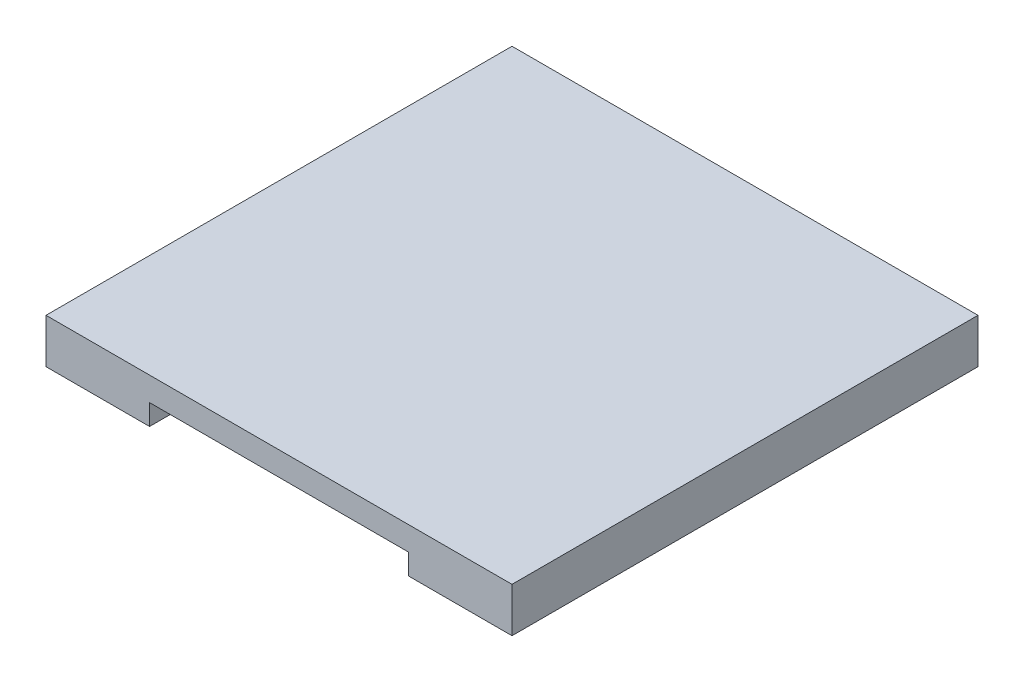
ISO-10303-21;
HEADER;
FILE_DESCRIPTION(('STEP AP214'),'2;1');
FILE_NAME('part.step','',(''),(''),'','','');
FILE_SCHEMA(('AUTOMOTIVE_DESIGN { 1 0 10303 214 1 1 1 1 }'));
ENDSEC;
DATA;
#1=APPLICATION_CONTEXT('core data for automotive mechanical design processes');
#2=APPLICATION_PROTOCOL_DEFINITION('international standard','automotive_design',2000,#1);
#3=PRODUCT_CONTEXT('',#1,'mechanical');
#4=PRODUCT('Part','Part','',(#3));
#5=PRODUCT_RELATED_PRODUCT_CATEGORY('part','',(#4));
#6=PRODUCT_DEFINITION_FORMATION('','',#4);
#7=PRODUCT_DEFINITION_CONTEXT('part definition',#1,'design');
#8=PRODUCT_DEFINITION('design','',#6,#7);
#9=PRODUCT_DEFINITION_SHAPE('','',#8);
#10=(LENGTH_UNIT() NAMED_UNIT(*) SI_UNIT(.MILLI.,.METRE.));
#11=(NAMED_UNIT(*) PLANE_ANGLE_UNIT() SI_UNIT($,.RADIAN.));
#12=(NAMED_UNIT(*) SI_UNIT($,.STERADIAN.) SOLID_ANGLE_UNIT());
#13=UNCERTAINTY_MEASURE_WITH_UNIT(LENGTH_MEASURE(1.E-05),#10,'distance_accuracy_value','');
#14=(GEOMETRIC_REPRESENTATION_CONTEXT(3) GLOBAL_UNCERTAINTY_ASSIGNED_CONTEXT((#13)) GLOBAL_UNIT_ASSIGNED_CONTEXT((#10,
#11,#12)) REPRESENTATION_CONTEXT('',''));
#15=CARTESIAN_POINT('',(0.,0.,0.));
#16=DIRECTION('',(0.,0.,1.));
#17=DIRECTION('',(1.,0.,0.));
#18=AXIS2_PLACEMENT_3D('',#15,#16,#17);
#19=CARTESIAN_POINT('',(0.,79.,0.));
#20=DIRECTION('',(0.,1.,0.));
#21=DIRECTION('',(0.,0.,1.));
#22=AXIS2_PLACEMENT_3D('',#19,#20,#21);
#23=PLANE('',#22);
#24=DIRECTION('',(-1.,0.,0.));
#25=VECTOR('',#24,1.);
#26=CARTESIAN_POINT('',(-45.,79.,-45.));
#27=LINE('',#26,#25);
#28=CARTESIAN_POINT('',(7.49999999999999,79.,-45.));
#29=VERTEX_POINT('',#28);
#30=CARTESIAN_POINT('',(-7.50000000000001,79.,-45.));
#31=VERTEX_POINT('',#30);
#32=EDGE_CURVE('E213',#29,#31,#27,.T.);
#33=ORIENTED_EDGE('',*,*,#32,.F.);
#34=DIRECTION('',(0.,0.,-1.));
#35=VECTOR('',#34,1.);
#36=CARTESIAN_POINT('',(7.49999999999999,79.,-45.));
#37=LINE('',#36,#35);
#38=CARTESIAN_POINT('',(7.49999999999999,79.,-27.2));
#39=VERTEX_POINT('',#38);
#40=EDGE_CURVE('E11',#39,#29,#37,.T.);
#41=ORIENTED_EDGE('',*,*,#40,.F.);
#42=DIRECTION('',(-1.,0.,0.));
#43=VECTOR('',#42,1.);
#44=CARTESIAN_POINT('',(45.,79.,-27.2));
#45=LINE('',#44,#43);
#46=CARTESIAN_POINT('',(-7.50000000000001,79.,-27.2));
#47=VERTEX_POINT('',#46);
#48=EDGE_CURVE('E211',#39,#47,#45,.T.);
#49=ORIENTED_EDGE('',*,*,#48,.T.);
#50=DIRECTION('',(0.,0.,1.));
#51=VECTOR('',#50,1.);
#52=CARTESIAN_POINT('',(-7.50000000000001,79.,-45.));
#53=LINE('',#52,#51);
#54=EDGE_CURVE('E221',#31,#47,#53,.T.);
#55=ORIENTED_EDGE('',*,*,#54,.F.);
#56=EDGE_LOOP('',(#33,#41,#49,#55));
#57=FACE_BOUND('',#56,.T.);
#58=DIRECTION('',(0.,0.,1.));
#59=VECTOR('',#58,1.);
#60=CARTESIAN_POINT('',(4.09999999999999,79.,-41.75));
#61=LINE('',#60,#59);
#62=CARTESIAN_POINT('',(4.09999999999999,79.,-41.75));
#63=VERTEX_POINT('',#62);
#64=CARTESIAN_POINT('',(4.09999999999999,79.,-30.45));
#65=VERTEX_POINT('',#64);
#66=EDGE_CURVE('E51',#63,#65,#61,.T.);
#67=ORIENTED_EDGE('',*,*,#66,.F.);
#68=DIRECTION('',(1.,0.,0.));
#69=VECTOR('',#68,1.);
#70=CARTESIAN_POINT('',(4.09999999999999,79.,-41.75));
#71=LINE('',#70,#69);
#72=CARTESIAN_POINT('',(-4.1,79.,-41.75));
#73=VERTEX_POINT('',#72);
#74=EDGE_CURVE('E55',#73,#63,#71,.T.);
#75=ORIENTED_EDGE('',*,*,#74,.F.);
#76=DIRECTION('',(0.,0.,-1.));
#77=VECTOR('',#76,1.);
#78=CARTESIAN_POINT('',(-4.1,79.,-41.75));
#79=LINE('',#78,#77);
#80=CARTESIAN_POINT('',(-4.1,79.,-30.45));
#81=VERTEX_POINT('',#80);
#82=EDGE_CURVE('E680',#81,#73,#79,.T.);
#83=ORIENTED_EDGE('',*,*,#82,.F.);
#84=DIRECTION('',(-1.,0.,0.));
#85=VECTOR('',#84,1.);
#86=CARTESIAN_POINT('',(4.09999999999999,79.,-30.45));
#87=LINE('',#86,#85);
#88=EDGE_CURVE('E686',#65,#81,#87,.T.);
#89=ORIENTED_EDGE('',*,*,#88,.F.);
#90=EDGE_LOOP('',(#67,#75,#83,#89));
#91=FACE_BOUND('',#90,.T.);
#92=ADVANCED_FACE('F36',(#57,#91),#23,.F.);
#93=CARTESIAN_POINT('',(0.,91.4,0.));
#94=DIRECTION('',(0.,1.,0.));
#95=DIRECTION('',(0.,0.,1.));
#96=AXIS2_PLACEMENT_3D('',#93,#94,#95);
#97=PLANE('',#96);
#98=DIRECTION('',(1.,0.,0.));
#99=VECTOR('',#98,1.);
#100=CARTESIAN_POINT('',(45.,91.4,-25.2));
#101=LINE('',#100,#99);
#102=CARTESIAN_POINT('',(25.,91.4,-25.2));
#103=VERTEX_POINT('',#102);
#104=CARTESIAN_POINT('',(25.7966933112238,91.4,-25.2));
#105=VERTEX_POINT('',#104);
#106=EDGE_CURVE('E339',#103,#105,#101,.T.);
#107=ORIENTED_EDGE('',*,*,#106,.T.);
#108=DIRECTION('',(0.,0.,1.));
#109=VECTOR('',#108,1.);
#110=CARTESIAN_POINT('',(25.7966933112238,91.4,-45.));
#111=LINE('',#110,#109);
#112=CARTESIAN_POINT('',(25.7966933112238,91.4,-45.));
#113=VERTEX_POINT('',#112);
#114=EDGE_CURVE('E308',#105,#113,#111,.F.);
#115=ORIENTED_EDGE('',*,*,#114,.T.);
#116=DIRECTION('',(-1.,0.,0.));
#117=VECTOR('',#116,1.);
#118=CARTESIAN_POINT('',(-45.,91.4,-45.));
#119=LINE('',#118,#117);
#120=CARTESIAN_POINT('',(45.,91.4,-45.));
#121=VERTEX_POINT('',#120);
#122=EDGE_CURVE('E246',#121,#113,#119,.T.);
#123=ORIENTED_EDGE('',*,*,#122,.F.);
#124=DIRECTION('',(0.,0.,-1.));
#125=VECTOR('',#124,1.);
#126=CARTESIAN_POINT('',(45.,91.4,-45.));
#127=LINE('',#126,#125);
#128=CARTESIAN_POINT('',(45.,91.4,45.));
#129=VERTEX_POINT('',#128);
#130=EDGE_CURVE('E259',#129,#121,#127,.T.);
#131=ORIENTED_EDGE('',*,*,#130,.F.);
#132=DIRECTION('',(1.,0.,0.));
#133=VECTOR('',#132,1.);
#134=CARTESIAN_POINT('',(-45.,91.4,45.));
#135=LINE('',#134,#133);
#136=CARTESIAN_POINT('',(25.,91.4,45.));
#137=VERTEX_POINT('',#136);
#138=EDGE_CURVE('E255',#137,#129,#135,.T.);
#139=ORIENTED_EDGE('',*,*,#138,.F.);
#140=DIRECTION('',(0.,0.,1.));
#141=VECTOR('',#140,1.);
#142=CARTESIAN_POINT('',(25.,91.4,-27.2));
#143=LINE('',#142,#141);
#144=EDGE_CURVE('E239',#103,#137,#143,.T.);
#145=ORIENTED_EDGE('',*,*,#144,.F.);
#146=EDGE_LOOP('',(#107,#115,#123,#131,#139,#145));
#147=FACE_BOUND('',#146,.T.);
#148=ADVANCED_FACE('F397',(#147),#97,.F.);
#149=CARTESIAN_POINT('',(-45.,4.,-45.));
#150=DIRECTION('',(0.,0.,1.));
#151=DIRECTION('',(1.,0.,0.));
#152=AXIS2_PLACEMENT_3D('',#149,#150,#151);
#153=PLANE('',#152);
#154=DIRECTION('',(0.,-1.,0.));
#155=VECTOR('',#154,1.);
#156=CARTESIAN_POINT('',(7.49999999999999,91.4,-45.));
#157=LINE('',#156,#155);
#158=CARTESIAN_POINT('',(7.49999999999999,79.6590323935863,-45.));
#159=VERTEX_POINT('',#158);
#160=EDGE_CURVE('E278',#159,#29,#157,.T.);
#161=ORIENTED_EDGE('',*,*,#160,.T.);
#162=ORIENTED_EDGE('',*,*,#32,.T.);
#163=DIRECTION('',(0.,-1.,0.));
#164=VECTOR('',#163,1.);
#165=CARTESIAN_POINT('',(-7.50000000000001,91.4,-45.));
#166=LINE('',#165,#164);
#167=CARTESIAN_POINT('',(-7.50000000000001,79.6590323935863,-45.));
#168=VERTEX_POINT('',#167);
#169=EDGE_CURVE('E275',#168,#31,#166,.T.);
#170=ORIENTED_EDGE('',*,*,#169,.F.);
#171=CARTESIAN_POINT('',(-10.5,79.6590323935863,-45.));
#172=DIRECTION('',(0.,0.,1.));
#173=DIRECTION('',(1.,0.,0.));
#174=AXIS2_PLACEMENT_3D('',#171,#172,#173);
#175=CIRCLE('',#174,3.);
#176=CARTESIAN_POINT('',(-9.01158318492949,82.2637618199597,-45.));
#177=VERTEX_POINT('',#176);
#178=EDGE_CURVE('E320',#168,#177,#175,.T.);
#179=ORIENTED_EDGE('',*,*,#178,.T.);
#180=DIRECTION('',(0.868243142124459,-0.496138938356835,0.));
#181=VECTOR('',#180,1.);
#182=CARTESIAN_POINT('',(-2.42769230769218,78.5015384615384,-45.));
#183=LINE('',#182,#181);
#184=CARTESIAN_POINT('',(-24.3082764961533,91.0047294263734,-45.));
#185=VERTEX_POINT('',#184);
#186=EDGE_CURVE('E289',#177,#185,#183,.F.);
#187=ORIENTED_EDGE('',*,*,#186,.T.);
#188=CARTESIAN_POINT('',(-25.7966933112238,88.4,-45.));
#189=DIRECTION('',(0.,0.,1.));
#190=DIRECTION('',(1.,0.,0.));
#191=AXIS2_PLACEMENT_3D('',#188,#189,#190);
#192=CIRCLE('',#191,3.);
#193=CARTESIAN_POINT('',(-25.7966933112238,91.4,-45.));
#194=VERTEX_POINT('',#193);
#195=EDGE_CURVE('E318',#185,#194,#192,.T.);
#196=ORIENTED_EDGE('',*,*,#195,.T.);
#197=CARTESIAN_POINT('',(-45.,91.4,-45.));
#198=VERTEX_POINT('',#197);
#199=EDGE_CURVE('E261',#194,#198,#119,.T.);
#200=ORIENTED_EDGE('',*,*,#199,.T.);
#201=DIRECTION('',(0.,-1.,0.));
#202=VECTOR('',#201,1.);
#203=CARTESIAN_POINT('',(-45.,100.,-45.));
#204=LINE('',#203,#202);
#205=CARTESIAN_POINT('',(-45.,100.,-45.));
#206=VERTEX_POINT('',#205);
#207=EDGE_CURVE('E252',#206,#198,#204,.T.);
#208=ORIENTED_EDGE('',*,*,#207,.F.);
#209=DIRECTION('',(-1.,0.,0.));
#210=VECTOR('',#209,1.);
#211=CARTESIAN_POINT('',(-45.,100.,-45.));
#212=LINE('',#211,#210);
#213=CARTESIAN_POINT('',(45.,100.,-45.));
#214=VERTEX_POINT('',#213);
#215=EDGE_CURVE('E250',#214,#206,#212,.T.);
#216=ORIENTED_EDGE('',*,*,#215,.F.);
#217=DIRECTION('',(0.,-1.,0.));
#218=VECTOR('',#217,1.);
#219=CARTESIAN_POINT('',(45.,100.,-45.));
#220=LINE('',#219,#218);
#221=EDGE_CURVE('E266',#214,#121,#220,.T.);
#222=ORIENTED_EDGE('',*,*,#221,.T.);
#223=ORIENTED_EDGE('',*,*,#122,.T.);
#224=CARTESIAN_POINT('',(25.7966933112238,88.4,-45.));
#225=DIRECTION('',(0.,0.,1.));
#226=DIRECTION('',(1.,0.,0.));
#227=AXIS2_PLACEMENT_3D('',#224,#225,#226);
#228=CIRCLE('',#227,3.);
#229=CARTESIAN_POINT('',(24.3082764961533,91.0047294263734,-45.));
#230=VERTEX_POINT('',#229);
#231=EDGE_CURVE('E324',#113,#230,#228,.T.);
#232=ORIENTED_EDGE('',*,*,#231,.T.);
#233=DIRECTION('',(0.868243142124459,0.496138938356835,0.));
#234=VECTOR('',#233,1.);
#235=CARTESIAN_POINT('',(-65.4184615384615,39.7323076923076,-45.));
#236=LINE('',#235,#234);
#237=CARTESIAN_POINT('',(9.01158318492949,82.2637618199597,-45.));
#238=VERTEX_POINT('',#237);
#239=EDGE_CURVE('E292',#230,#238,#236,.F.);
#240=ORIENTED_EDGE('',*,*,#239,.T.);
#241=CARTESIAN_POINT('',(10.5,79.6590323935863,-45.));
#242=DIRECTION('',(0.,0.,1.));
#243=DIRECTION('',(1.,0.,0.));
#244=AXIS2_PLACEMENT_3D('',#241,#242,#243);
#245=CIRCLE('',#244,3.);
#246=EDGE_CURVE('E328',#238,#159,#245,.T.);
#247=ORIENTED_EDGE('',*,*,#246,.T.);
#248=EDGE_LOOP('',(#161,#162,#170,#179,#187,#196,#200,#208,#216,#222,#223,#232,#240,#247));
#249=FACE_BOUND('',#248,.T.);
#250=ADVANCED_FACE('F383',(#249),#153,.F.);
#251=CARTESIAN_POINT('',(45.,41.4,-27.2));
#252=DIRECTION('',(0.,0.,1.));
#253=DIRECTION('',(1.,0.,0.));
#254=AXIS2_PLACEMENT_3D('',#251,#252,#253);
#255=PLANE('',#254);
#256=ORIENTED_EDGE('',*,*,#48,.F.);
#257=DIRECTION('',(0.,-1.,0.));
#258=VECTOR('',#257,1.);
#259=CARTESIAN_POINT('',(7.49999999999999,91.4,-27.2));
#260=LINE('',#259,#258);
#261=CARTESIAN_POINT('',(7.49999999999999,79.6590323935863,-27.2));
#262=VERTEX_POINT('',#261);
#263=EDGE_CURVE('E281',#262,#39,#260,.T.);
#264=ORIENTED_EDGE('',*,*,#263,.F.);
#265=CARTESIAN_POINT('',(10.5,79.6590323935863,-27.2));
#266=DIRECTION('',(0.,0.,1.));
#267=DIRECTION('',(1.,0.,0.));
#268=AXIS2_PLACEMENT_3D('',#265,#266,#267);
#269=CIRCLE('',#268,3.);
#270=CARTESIAN_POINT('',(9.01158318492948,82.2637618199597,-27.2));
#271=VERTEX_POINT('',#270);
#272=EDGE_CURVE('E326',#262,#271,#269,.F.);
#273=ORIENTED_EDGE('',*,*,#272,.T.);
#274=DIRECTION('',(-0.868243142124459,-0.496138938356835,0.));
#275=VECTOR('',#274,1.);
#276=CARTESIAN_POINT('',(24.9999999999999,91.4,-27.2));
#277=LINE('',#276,#275);
#278=CARTESIAN_POINT('',(23.2499999999999,90.4,-27.2));
#279=VERTEX_POINT('',#278);
#280=EDGE_CURVE('E295',#271,#279,#277,.F.);
#281=ORIENTED_EDGE('',*,*,#280,.T.);
#282=DIRECTION('',(-1.,0.,0.));
#283=VECTOR('',#282,1.);
#284=CARTESIAN_POINT('',(45.,90.4,-27.2));
#285=LINE('',#284,#283);
#286=CARTESIAN_POINT('',(-23.2499999999999,90.4,-27.2));
#287=VERTEX_POINT('',#286);
#288=EDGE_CURVE('E330',#279,#287,#285,.T.);
#289=ORIENTED_EDGE('',*,*,#288,.T.);
#290=DIRECTION('',(-0.868243142124459,0.496138938356835,0.));
#291=VECTOR('',#290,1.);
#292=CARTESIAN_POINT('',(-24.9999999999999,91.4,-27.2));
#293=LINE('',#292,#291);
#294=CARTESIAN_POINT('',(-9.0115831849295,82.2637618199597,-27.2));
#295=VERTEX_POINT('',#294);
#296=EDGE_CURVE('E287',#287,#295,#293,.F.);
#297=ORIENTED_EDGE('',*,*,#296,.T.);
#298=CARTESIAN_POINT('',(-10.5,79.6590323935863,-27.2));
#299=DIRECTION('',(0.,0.,1.));
#300=DIRECTION('',(1.,0.,0.));
#301=AXIS2_PLACEMENT_3D('',#298,#299,#300);
#302=CIRCLE('',#301,3.);
#303=CARTESIAN_POINT('',(-7.5,79.6590323935863,-27.2));
#304=VERTEX_POINT('',#303);
#305=EDGE_CURVE('E322',#295,#304,#302,.F.);
#306=ORIENTED_EDGE('',*,*,#305,.T.);
#307=DIRECTION('',(0.,-1.,0.));
#308=VECTOR('',#307,1.);
#309=CARTESIAN_POINT('',(-7.5,91.4,-27.2));
#310=LINE('',#309,#308);
#311=EDGE_CURVE('E284',#304,#47,#310,.T.);
#312=ORIENTED_EDGE('',*,*,#311,.T.);
#313=EDGE_LOOP('',(#256,#264,#273,#281,#289,#297,#306,#312));
#314=FACE_BOUND('',#313,.T.);
#315=ADVANCED_FACE('F364',(#314),#255,.T.);
#316=CARTESIAN_POINT('',(-7.50000000000001,91.4,-45.));
#317=DIRECTION('',(1.,0.,0.));
#318=DIRECTION('',(0.,0.,-1.));
#319=AXIS2_PLACEMENT_3D('',#316,#317,#318);
#320=PLANE('',#319);
#321=ORIENTED_EDGE('',*,*,#169,.T.);
#322=ORIENTED_EDGE('',*,*,#54,.T.);
#323=ORIENTED_EDGE('',*,*,#311,.F.);
#324=DIRECTION('',(0.,0.,1.));
#325=VECTOR('',#324,1.);
#326=CARTESIAN_POINT('',(-7.50000000000001,79.6590323935863,-45.));
#327=LINE('',#326,#325);
#328=EDGE_CURVE('E305',#304,#168,#327,.F.);
#329=ORIENTED_EDGE('',*,*,#328,.T.);
#330=EDGE_LOOP('',(#321,#322,#323,#329));
#331=FACE_BOUND('',#330,.T.);
#332=ADVANCED_FACE('F379',(#331),#320,.F.);
#333=CARTESIAN_POINT('',(7.49999999999999,91.4,-45.));
#334=DIRECTION('',(-1.,0.,0.));
#335=DIRECTION('',(0.,0.,1.));
#336=AXIS2_PLACEMENT_3D('',#333,#334,#335);
#337=PLANE('',#336);
#338=ORIENTED_EDGE('',*,*,#263,.T.);
#339=ORIENTED_EDGE('',*,*,#40,.T.);
#340=ORIENTED_EDGE('',*,*,#160,.F.);
#341=DIRECTION('',(0.,0.,-1.));
#342=VECTOR('',#341,1.);
#343=CARTESIAN_POINT('',(7.49999999999999,79.6590323935863,-27.2));
#344=LINE('',#343,#342);
#345=EDGE_CURVE('E315',#159,#262,#344,.F.);
#346=ORIENTED_EDGE('',*,*,#345,.T.);
#347=EDGE_LOOP('',(#338,#339,#340,#346));
#348=FACE_BOUND('',#347,.T.);
#349=ADVANCED_FACE('F388',(#348),#337,.F.);
#350=DIRECTION('',(0.,0.,-1.));
#351=VECTOR('',#350,1.);
#352=CARTESIAN_POINT('',(-25.7966933112238,91.4,-27.2));
#353=LINE('',#352,#351);
#354=CARTESIAN_POINT('',(-25.7966933112238,91.4,-25.2));
#355=VERTEX_POINT('',#354);
#356=EDGE_CURVE('E298',#194,#355,#353,.F.);
#357=ORIENTED_EDGE('',*,*,#356,.T.);
#358=DIRECTION('',(1.,0.,0.));
#359=VECTOR('',#358,1.);
#360=CARTESIAN_POINT('',(45.,91.4,-25.2));
#361=LINE('',#360,#359);
#362=CARTESIAN_POINT('',(-25.,91.4,-25.2));
#363=VERTEX_POINT('',#362);
#364=EDGE_CURVE('E333',#355,#363,#361,.T.);
#365=ORIENTED_EDGE('',*,*,#364,.T.);
#366=DIRECTION('',(0.,0.,1.));
#367=VECTOR('',#366,1.);
#368=CARTESIAN_POINT('',(-25.,91.4,-27.2));
#369=LINE('',#368,#367);
#370=CARTESIAN_POINT('',(-25.,91.4,45.));
#371=VERTEX_POINT('',#370);
#372=EDGE_CURVE('E233',#363,#371,#369,.T.);
#373=ORIENTED_EDGE('',*,*,#372,.T.);
#374=CARTESIAN_POINT('',(-45.,91.4,45.));
#375=VERTEX_POINT('',#374);
#376=EDGE_CURVE('E256',#375,#371,#135,.T.);
#377=ORIENTED_EDGE('',*,*,#376,.F.);
#378=DIRECTION('',(0.,0.,1.));
#379=VECTOR('',#378,1.);
#380=CARTESIAN_POINT('',(-45.,91.4,-45.));
#381=LINE('',#380,#379);
#382=EDGE_CURVE('E236',#198,#375,#381,.T.);
#383=ORIENTED_EDGE('',*,*,#382,.F.);
#384=ORIENTED_EDGE('',*,*,#199,.F.);
#385=EDGE_LOOP('',(#357,#365,#373,#377,#383,#384));
#386=FACE_BOUND('',#385,.T.);
#387=ADVANCED_FACE('F417',(#386),#97,.F.);
#388=CARTESIAN_POINT('',(-45.,100.,-45.));
#389=DIRECTION('',(1.,0.,0.));
#390=DIRECTION('',(0.,0.,-1.));
#391=AXIS2_PLACEMENT_3D('',#388,#389,#390);
#392=PLANE('',#391);
#393=ORIENTED_EDGE('',*,*,#382,.T.);
#394=DIRECTION('',(0.,-1.,0.));
#395=VECTOR('',#394,1.);
#396=CARTESIAN_POINT('',(-45.,100.,45.));
#397=LINE('',#396,#395);
#398=CARTESIAN_POINT('',(-45.,100.,45.));
#399=VERTEX_POINT('',#398);
#400=EDGE_CURVE('E272',#399,#375,#397,.T.);
#401=ORIENTED_EDGE('',*,*,#400,.F.);
#402=DIRECTION('',(0.,0.,1.));
#403=VECTOR('',#402,1.);
#404=CARTESIAN_POINT('',(-45.,100.,-45.));
#405=LINE('',#404,#403);
#406=EDGE_CURVE('E242',#206,#399,#405,.T.);
#407=ORIENTED_EDGE('',*,*,#406,.F.);
#408=ORIENTED_EDGE('',*,*,#207,.T.);
#409=EDGE_LOOP('',(#393,#401,#407,#408));
#410=FACE_BOUND('',#409,.T.);
#411=ADVANCED_FACE('F427',(#410),#392,.F.);
#412=CARTESIAN_POINT('',(-45.,100.,45.));
#413=DIRECTION('',(0.,0.,-1.));
#414=DIRECTION('',(-1.,0.,0.));
#415=AXIS2_PLACEMENT_3D('',#412,#413,#414);
#416=PLANE('',#415);
#417=ORIENTED_EDGE('',*,*,#376,.T.);
#418=DIRECTION('',(0.,-1.,0.));
#419=VECTOR('',#418,1.);
#420=CARTESIAN_POINT('',(-25.,91.4,45.));
#421=LINE('',#420,#419);
#422=CARTESIAN_POINT('',(-25.,95.4,45.));
#423=VERTEX_POINT('',#422);
#424=EDGE_CURVE('E224',#423,#371,#421,.T.);
#425=ORIENTED_EDGE('',*,*,#424,.F.);
#426=DIRECTION('',(-1.,0.,0.));
#427=VECTOR('',#426,1.);
#428=CARTESIAN_POINT('',(-25.,95.4,45.));
#429=LINE('',#428,#427);
#430=CARTESIAN_POINT('',(25.,95.4,45.));
#431=VERTEX_POINT('',#430);
#432=EDGE_CURVE('E230',#431,#423,#429,.T.);
#433=ORIENTED_EDGE('',*,*,#432,.F.);
#434=DIRECTION('',(0.,1.,0.));
#435=VECTOR('',#434,1.);
#436=CARTESIAN_POINT('',(25.,91.4,45.));
#437=LINE('',#436,#435);
#438=EDGE_CURVE('E227',#137,#431,#437,.T.);
#439=ORIENTED_EDGE('',*,*,#438,.F.);
#440=ORIENTED_EDGE('',*,*,#138,.T.);
#441=DIRECTION('',(0.,-1.,0.));
#442=VECTOR('',#441,1.);
#443=CARTESIAN_POINT('',(45.,100.,45.));
#444=LINE('',#443,#442);
#445=CARTESIAN_POINT('',(45.,100.,45.));
#446=VERTEX_POINT('',#445);
#447=EDGE_CURVE('E269',#446,#129,#444,.T.);
#448=ORIENTED_EDGE('',*,*,#447,.F.);
#449=DIRECTION('',(1.,0.,0.));
#450=VECTOR('',#449,1.);
#451=CARTESIAN_POINT('',(-45.,100.,45.));
#452=LINE('',#451,#450);
#453=EDGE_CURVE('E245',#399,#446,#452,.T.);
#454=ORIENTED_EDGE('',*,*,#453,.F.);
#455=ORIENTED_EDGE('',*,*,#400,.T.);
#456=EDGE_LOOP('',(#417,#425,#433,#439,#440,#448,#454,#455));
#457=FACE_BOUND('',#456,.T.);
#458=ADVANCED_FACE('F430',(#457),#416,.F.);
#459=CARTESIAN_POINT('',(45.,100.,-45.));
#460=DIRECTION('',(-1.,0.,0.));
#461=DIRECTION('',(0.,0.,1.));
#462=AXIS2_PLACEMENT_3D('',#459,#460,#461);
#463=PLANE('',#462);
#464=ORIENTED_EDGE('',*,*,#130,.T.);
#465=ORIENTED_EDGE('',*,*,#221,.F.);
#466=DIRECTION('',(0.,0.,-1.));
#467=VECTOR('',#466,1.);
#468=CARTESIAN_POINT('',(45.,100.,-45.));
#469=LINE('',#468,#467);
#470=EDGE_CURVE('E248',#446,#214,#469,.T.);
#471=ORIENTED_EDGE('',*,*,#470,.F.);
#472=ORIENTED_EDGE('',*,*,#447,.T.);
#473=EDGE_LOOP('',(#464,#465,#471,#472));
#474=FACE_BOUND('',#473,.T.);
#475=ADVANCED_FACE('F437',(#474),#463,.F.);
#476=CARTESIAN_POINT('',(0.,100.,0.));
#477=DIRECTION('',(0.,1.,0.));
#478=DIRECTION('',(0.,0.,1.));
#479=AXIS2_PLACEMENT_3D('',#476,#477,#478);
#480=PLANE('',#479);
#481=ORIENTED_EDGE('',*,*,#406,.T.);
#482=ORIENTED_EDGE('',*,*,#453,.T.);
#483=ORIENTED_EDGE('',*,*,#470,.T.);
#484=ORIENTED_EDGE('',*,*,#215,.T.);
#485=EDGE_LOOP('',(#481,#482,#483,#484));
#486=FACE_BOUND('',#485,.T.);
#487=ADVANCED_FACE('F434',(#486),#480,.T.);
#488=CARTESIAN_POINT('',(-25.,91.4,-27.2));
#489=DIRECTION('',(-1.,0.,0.));
#490=DIRECTION('',(0.,-1.,0.));
#491=AXIS2_PLACEMENT_3D('',#488,#489,#490);
#492=PLANE('',#491);
#493=ORIENTED_EDGE('',*,*,#372,.F.);
#494=DIRECTION('',(0.,0.447213595499961,0.894427190999915));
#495=VECTOR('',#494,1.);
#496=CARTESIAN_POINT('',(-25.,90.4,-27.2));
#497=LINE('',#496,#495);
#498=CARTESIAN_POINT('',(-25.,95.4,-17.2000000000001));
#499=VERTEX_POINT('',#498);
#500=EDGE_CURVE('E335',#363,#499,#497,.T.);
#501=ORIENTED_EDGE('',*,*,#500,.T.);
#502=DIRECTION('',(0.,0.,1.));
#503=VECTOR('',#502,1.);
#504=CARTESIAN_POINT('',(-25.,95.4,-27.2));
#505=LINE('',#504,#503);
#506=EDGE_CURVE('E234',#499,#423,#505,.T.);
#507=ORIENTED_EDGE('',*,*,#506,.T.);
#508=ORIENTED_EDGE('',*,*,#424,.T.);
#509=EDGE_LOOP('',(#493,#501,#507,#508));
#510=FACE_BOUND('',#509,.T.);
#511=ADVANCED_FACE('F415',(#510),#492,.F.);
#512=CARTESIAN_POINT('',(-25.,95.4,-27.2));
#513=DIRECTION('',(0.,1.,0.));
#514=DIRECTION('',(0.,0.,1.));
#515=AXIS2_PLACEMENT_3D('',#512,#513,#514);
#516=PLANE('',#515);
#517=ORIENTED_EDGE('',*,*,#506,.F.);
#518=DIRECTION('',(1.,0.,0.));
#519=VECTOR('',#518,1.);
#520=CARTESIAN_POINT('',(-25.,95.4,-17.2000000000001));
#521=LINE('',#520,#519);
#522=CARTESIAN_POINT('',(25.,95.4,-17.2000000000001));
#523=VERTEX_POINT('',#522);
#524=EDGE_CURVE('E337',#499,#523,#521,.T.);
#525=ORIENTED_EDGE('',*,*,#524,.T.);
#526=DIRECTION('',(0.,0.,1.));
#527=VECTOR('',#526,1.);
#528=CARTESIAN_POINT('',(25.,95.4,-27.2));
#529=LINE('',#528,#527);
#530=EDGE_CURVE('E237',#523,#431,#529,.T.);
#531=ORIENTED_EDGE('',*,*,#530,.T.);
#532=ORIENTED_EDGE('',*,*,#432,.T.);
#533=EDGE_LOOP('',(#517,#525,#531,#532));
#534=FACE_BOUND('',#533,.T.);
#535=ADVANCED_FACE('F411',(#534),#516,.F.);
#536=CARTESIAN_POINT('',(25.,91.4,-27.2));
#537=DIRECTION('',(1.,0.,0.));
#538=DIRECTION('',(0.,0.,-1.));
#539=AXIS2_PLACEMENT_3D('',#536,#537,#538);
#540=PLANE('',#539);
#541=ORIENTED_EDGE('',*,*,#530,.F.);
#542=DIRECTION('',(0.,-0.447213595499961,-0.894427190999915));
#543=VECTOR('',#542,1.);
#544=CARTESIAN_POINT('',(25.,90.4,-27.2));
#545=LINE('',#544,#543);
#546=EDGE_CURVE('E342',#523,#103,#545,.T.);
#547=ORIENTED_EDGE('',*,*,#546,.T.);
#548=ORIENTED_EDGE('',*,*,#144,.T.);
#549=ORIENTED_EDGE('',*,*,#438,.T.);
#550=EDGE_LOOP('',(#541,#547,#548,#549));
#551=FACE_BOUND('',#550,.T.);
#552=ADVANCED_FACE('F406',(#551),#540,.F.);
#553=CARTESIAN_POINT('',(-24.9999999999999,91.4,0.));
#554=DIRECTION('',(-0.496138938356835,-0.868243142124459,0.));
#555=DIRECTION('',(0.,0.,-1.));
#556=AXIS2_PLACEMENT_3D('',#553,#554,#555);
#557=PLANE('',#556);
#558=ORIENTED_EDGE('',*,*,#296,.F.);
#559=DIRECTION('',(0.616315634427938,-0.352180362530251,-0.704360725060497));
#560=VECTOR('',#559,1.);
#561=CARTESIAN_POINT('',(-35.9395348837208,97.6511627906977,-12.6976744186047));
#562=LINE('',#561,#560);
#563=CARTESIAN_POINT('',(-24.3082764961533,91.0047294263734,-25.9905411472532));
#564=VERTEX_POINT('',#563);
#565=EDGE_CURVE('E344',#287,#564,#562,.F.);
#566=ORIENTED_EDGE('',*,*,#565,.T.);
#567=DIRECTION('',(0.,0.,1.));
#568=VECTOR('',#567,1.);
#569=CARTESIAN_POINT('',(-24.3082764961533,91.0047294263734,-45.));
#570=LINE('',#569,#568);
#571=EDGE_CURVE('E303',#564,#185,#570,.F.);
#572=ORIENTED_EDGE('',*,*,#571,.T.);
#573=ORIENTED_EDGE('',*,*,#186,.F.);
#574=DIRECTION('',(0.,0.,-1.));
#575=VECTOR('',#574,1.);
#576=CARTESIAN_POINT('',(-9.0115831849295,82.2637618199597,-27.2));
#577=LINE('',#576,#575);
#578=EDGE_CURVE('E300',#177,#295,#577,.F.);
#579=ORIENTED_EDGE('',*,*,#578,.T.);
#580=EDGE_LOOP('',(#558,#566,#572,#573,#579));
#581=FACE_BOUND('',#580,.T.);
#582=ADVANCED_FACE('F371',(#581),#557,.T.);
#583=CARTESIAN_POINT('',(24.9999999999999,91.4,0.));
#584=DIRECTION('',(0.496138938356835,-0.868243142124459,0.));
#585=DIRECTION('',(0.,0.,1.));
#586=AXIS2_PLACEMENT_3D('',#583,#584,#585);
#587=PLANE('',#586);
#588=ORIENTED_EDGE('',*,*,#239,.F.);
#589=DIRECTION('',(0.,0.,-1.));
#590=VECTOR('',#589,1.);
#591=CARTESIAN_POINT('',(24.3082764961533,91.0047294263734,-27.2));
#592=LINE('',#591,#590);
#593=CARTESIAN_POINT('',(24.3082764961533,91.0047294263734,-25.9905411472533));
#594=VERTEX_POINT('',#593);
#595=EDGE_CURVE('E313',#230,#594,#592,.F.);
#596=ORIENTED_EDGE('',*,*,#595,.T.);
#597=DIRECTION('',(0.616315634427938,0.352180362530251,0.704360725060497));
#598=VECTOR('',#597,1.);
#599=CARTESIAN_POINT('',(35.9395348837208,97.6511627906977,-12.6976744186047));
#600=LINE('',#599,#598);
#601=EDGE_CURVE('E44',#594,#279,#600,.F.);
#602=ORIENTED_EDGE('',*,*,#601,.T.);
#603=ORIENTED_EDGE('',*,*,#280,.F.);
#604=DIRECTION('',(0.,0.,1.));
#605=VECTOR('',#604,1.);
#606=CARTESIAN_POINT('',(9.01158318492948,82.2637618199597,-45.));
#607=LINE('',#606,#605);
#608=EDGE_CURVE('E311',#271,#238,#607,.F.);
#609=ORIENTED_EDGE('',*,*,#608,.T.);
#610=EDGE_LOOP('',(#588,#596,#602,#603,#609));
#611=FACE_BOUND('',#610,.T.);
#612=ADVANCED_FACE('F356',(#611),#587,.T.);
#613=CARTESIAN_POINT('',(-25.7966933112238,88.4,0.));
#614=DIRECTION('',(0.,0.,1.));
#615=DIRECTION('',(1.,0.,0.));
#616=AXIS2_PLACEMENT_3D('',#613,#614,#615);
#617=CYLINDRICAL_SURFACE('',#616,3.);
#618=ORIENTED_EDGE('',*,*,#195,.F.);
#619=ORIENTED_EDGE('',*,*,#571,.F.);
#620=CARTESIAN_POINT('',(-25.7966933112238,88.4,-31.2));
#621=DIRECTION('',(0.,0.894427190999914,-0.447213595499961));
#622=DIRECTION('',(0.,0.447213595499961,0.894427190999915));
#623=AXIS2_PLACEMENT_3D('',#620,#621,#622);
#624=ELLIPSE('',#623,6.70820393249933,3.);
#625=EDGE_CURVE('E347',#564,#355,#624,.F.);
#626=ORIENTED_EDGE('',*,*,#625,.T.);
#627=ORIENTED_EDGE('',*,*,#356,.F.);
#628=EDGE_LOOP('',(#618,#619,#626,#627));
#629=FACE_BOUND('',#628,.T.);
#630=ADVANCED_FACE('F422',(#629),#617,.F.);
#631=CARTESIAN_POINT('',(-10.5,79.6590323935863,-45.));
#632=DIRECTION('',(0.,0.,-1.));
#633=DIRECTION('',(-1.,0.,0.));
#634=AXIS2_PLACEMENT_3D('',#631,#632,#633);
#635=CYLINDRICAL_SURFACE('',#634,3.);
#636=ORIENTED_EDGE('',*,*,#305,.F.);
#637=ORIENTED_EDGE('',*,*,#578,.F.);
#638=ORIENTED_EDGE('',*,*,#178,.F.);
#639=ORIENTED_EDGE('',*,*,#328,.F.);
#640=EDGE_LOOP('',(#636,#637,#638,#639));
#641=FACE_BOUND('',#640,.T.);
#642=ADVANCED_FACE('F381',(#641),#635,.F.);
#643=CARTESIAN_POINT('',(25.7966933112238,88.4,0.));
#644=DIRECTION('',(0.,0.,-1.));
#645=DIRECTION('',(-1.,0.,0.));
#646=AXIS2_PLACEMENT_3D('',#643,#644,#645);
#647=CYLINDRICAL_SURFACE('',#646,3.);
#648=ORIENTED_EDGE('',*,*,#114,.F.);
#649=CARTESIAN_POINT('',(25.7966933112238,88.4,-31.2));
#650=DIRECTION('',(0.,0.894427190999914,-0.447213595499961));
#651=DIRECTION('',(0.,-0.447213595499961,-0.894427190999915));
#652=AXIS2_PLACEMENT_3D('',#649,#650,#651);
#653=ELLIPSE('',#652,6.70820393249933,3.);
#654=EDGE_CURVE('E350',#105,#594,#653,.F.);
#655=ORIENTED_EDGE('',*,*,#654,.T.);
#656=ORIENTED_EDGE('',*,*,#595,.F.);
#657=ORIENTED_EDGE('',*,*,#231,.F.);
#658=EDGE_LOOP('',(#648,#655,#656,#657));
#659=FACE_BOUND('',#658,.T.);
#660=ADVANCED_FACE('F395',(#659),#647,.F.);
#661=CARTESIAN_POINT('',(10.5,79.6590323935863,-45.));
#662=DIRECTION('',(0.,0.,1.));
#663=DIRECTION('',(1.,0.,0.));
#664=AXIS2_PLACEMENT_3D('',#661,#662,#663);
#665=CYLINDRICAL_SURFACE('',#664,3.);
#666=ORIENTED_EDGE('',*,*,#246,.F.);
#667=ORIENTED_EDGE('',*,*,#608,.F.);
#668=ORIENTED_EDGE('',*,*,#272,.F.);
#669=ORIENTED_EDGE('',*,*,#345,.F.);
#670=EDGE_LOOP('',(#666,#667,#668,#669));
#671=FACE_BOUND('',#670,.T.);
#672=ADVANCED_FACE('F392',(#671),#665,.F.);
#673=CARTESIAN_POINT('',(45.,90.4,-27.2));
#674=DIRECTION('',(0.,0.894427190999914,-0.447213595499961));
#675=DIRECTION('',(-1.,0.,0.));
#676=AXIS2_PLACEMENT_3D('',#673,#674,#675);
#677=PLANE('',#676);
#678=ORIENTED_EDGE('',*,*,#546,.F.);
#679=ORIENTED_EDGE('',*,*,#524,.F.);
#680=ORIENTED_EDGE('',*,*,#500,.F.);
#681=ORIENTED_EDGE('',*,*,#364,.F.);
#682=ORIENTED_EDGE('',*,*,#625,.F.);
#683=ORIENTED_EDGE('',*,*,#565,.F.);
#684=ORIENTED_EDGE('',*,*,#288,.F.);
#685=ORIENTED_EDGE('',*,*,#601,.F.);
#686=ORIENTED_EDGE('',*,*,#654,.F.);
#687=ORIENTED_EDGE('',*,*,#106,.F.);
#688=EDGE_LOOP('',(#678,#679,#680,#681,#682,#683,#684,#685,#686,#687));
#689=FACE_BOUND('',#688,.T.);
#690=ADVANCED_FACE('F38',(#689),#677,.F.);
#691=CARTESIAN_POINT('',(4.09999999999999,64.,-41.75));
#692=DIRECTION('',(-1.,0.,0.));
#693=DIRECTION('',(0.,0.,1.));
#694=AXIS2_PLACEMENT_3D('',#691,#692,#693);
#695=PLANE('',#694);
#696=ORIENTED_EDGE('',*,*,#66,.T.);
#697=DIRECTION('',(0.,1.,0.));
#698=VECTOR('',#697,1.);
#699=CARTESIAN_POINT('',(4.09999999999999,64.,-30.45));
#700=LINE('',#699,#698);
#701=CARTESIAN_POINT('',(4.09999999999999,64.,-30.45));
#702=VERTEX_POINT('',#701);
#703=EDGE_CURVE('E194',#702,#65,#700,.T.);
#704=ORIENTED_EDGE('',*,*,#703,.F.);
#705=DIRECTION('',(0.,0.,1.));
#706=VECTOR('',#705,1.);
#707=CARTESIAN_POINT('',(4.09999999999999,64.,-41.75));
#708=LINE('',#707,#706);
#709=CARTESIAN_POINT('',(4.09999999999999,64.,-41.75));
#710=VERTEX_POINT('',#709);
#711=EDGE_CURVE('E200',#710,#702,#708,.T.);
#712=ORIENTED_EDGE('',*,*,#711,.F.);
#713=DIRECTION('',(0.,1.,0.));
#714=VECTOR('',#713,1.);
#715=CARTESIAN_POINT('',(4.09999999999999,64.,-41.75));
#716=LINE('',#715,#714);
#717=EDGE_CURVE('E678',#710,#63,#716,.T.);
#718=ORIENTED_EDGE('',*,*,#717,.T.);
#719=EDGE_LOOP('',(#696,#704,#712,#718));
#720=FACE_BOUND('',#719,.T.);
#721=ADVANCED_FACE('F210',(#720),#695,.F.);
#722=CARTESIAN_POINT('',(4.09999999999999,64.,-30.45));
#723=DIRECTION('',(0.,0.,-1.));
#724=DIRECTION('',(-1.,0.,0.));
#725=AXIS2_PLACEMENT_3D('',#722,#723,#724);
#726=PLANE('',#725);
#727=ORIENTED_EDGE('',*,*,#88,.T.);
#728=DIRECTION('',(0.,1.,0.));
#729=VECTOR('',#728,1.);
#730=CARTESIAN_POINT('',(-4.1,64.,-30.45));
#731=LINE('',#730,#729);
#732=CARTESIAN_POINT('',(-4.1,64.,-30.45));
#733=VERTEX_POINT('',#732);
#734=EDGE_CURVE('E196',#733,#81,#731,.T.);
#735=ORIENTED_EDGE('',*,*,#734,.F.);
#736=DIRECTION('',(-1.,0.,0.));
#737=VECTOR('',#736,1.);
#738=CARTESIAN_POINT('',(4.09999999999999,64.,-30.45));
#739=LINE('',#738,#737);
#740=EDGE_CURVE('E189',#702,#733,#739,.T.);
#741=ORIENTED_EDGE('',*,*,#740,.F.);
#742=ORIENTED_EDGE('',*,*,#703,.T.);
#743=EDGE_LOOP('',(#727,#735,#741,#742));
#744=FACE_BOUND('',#743,.T.);
#745=ADVANCED_FACE('F192',(#744),#726,.F.);
#746=CARTESIAN_POINT('',(-4.1,64.,-41.75));
#747=DIRECTION('',(1.,0.,0.));
#748=DIRECTION('',(0.,0.,-1.));
#749=AXIS2_PLACEMENT_3D('',#746,#747,#748);
#750=PLANE('',#749);
#751=ORIENTED_EDGE('',*,*,#82,.T.);
#752=DIRECTION('',(0.,1.,0.));
#753=VECTOR('',#752,1.);
#754=CARTESIAN_POINT('',(-4.1,64.,-41.75));
#755=LINE('',#754,#753);
#756=CARTESIAN_POINT('',(-4.1,64.,-41.75));
#757=VERTEX_POINT('',#756);
#758=EDGE_CURVE('E215',#757,#73,#755,.T.);
#759=ORIENTED_EDGE('',*,*,#758,.F.);
#760=DIRECTION('',(0.,0.,-1.));
#761=VECTOR('',#760,1.);
#762=CARTESIAN_POINT('',(-4.1,64.,-41.75));
#763=LINE('',#762,#761);
#764=EDGE_CURVE('E199',#733,#757,#763,.T.);
#765=ORIENTED_EDGE('',*,*,#764,.F.);
#766=ORIENTED_EDGE('',*,*,#734,.T.);
#767=EDGE_LOOP('',(#751,#759,#765,#766));
#768=FACE_BOUND('',#767,.T.);
#769=ADVANCED_FACE('F495',(#768),#750,.F.);
#770=CARTESIAN_POINT('',(4.09999999999999,64.,-41.75));
#771=DIRECTION('',(0.,0.,1.));
#772=DIRECTION('',(1.,0.,0.));
#773=AXIS2_PLACEMENT_3D('',#770,#771,#772);
#774=PLANE('',#773);
#775=ORIENTED_EDGE('',*,*,#74,.T.);
#776=ORIENTED_EDGE('',*,*,#717,.F.);
#777=DIRECTION('',(1.,0.,0.));
#778=VECTOR('',#777,1.);
#779=CARTESIAN_POINT('',(4.09999999999999,64.,-41.75));
#780=LINE('',#779,#778);
#781=EDGE_CURVE('E205',#757,#710,#780,.T.);
#782=ORIENTED_EDGE('',*,*,#781,.F.);
#783=ORIENTED_EDGE('',*,*,#758,.T.);
#784=EDGE_LOOP('',(#775,#776,#782,#783));
#785=FACE_BOUND('',#784,.T.);
#786=ADVANCED_FACE('F499',(#785),#774,.F.);
#787=CARTESIAN_POINT('',(0.,64.,0.));
#788=DIRECTION('',(0.,-1.,0.));
#789=DIRECTION('',(0.,0.,-1.));
#790=AXIS2_PLACEMENT_3D('',#787,#788,#789);
#791=PLANE('',#790);
#792=ORIENTED_EDGE('',*,*,#711,.T.);
#793=ORIENTED_EDGE('',*,*,#740,.T.);
#794=ORIENTED_EDGE('',*,*,#764,.T.);
#795=ORIENTED_EDGE('',*,*,#781,.T.);
#796=EDGE_LOOP('',(#792,#793,#794,#795));
#797=FACE_BOUND('',#796,.T.);
#798=ADVANCED_FACE('F203',(#797),#791,.T.);
#799=CLOSED_SHELL('',(#92,#148,#250,#315,#332,#349,#387,#411,#458,#475,#487,#511,#535,#552,#582,
#612,#630,#642,#660,#672,#690,#721,#745,#769,#786,#798));
#800=MANIFOLD_SOLID_BREP('B2',#799);
#801=ADVANCED_BREP_SHAPE_REPRESENTATION('',(#18,#800),#14);
#802=SHAPE_DEFINITION_REPRESENTATION(#9,#801);
ENDSEC;
END-ISO-10303-21;
